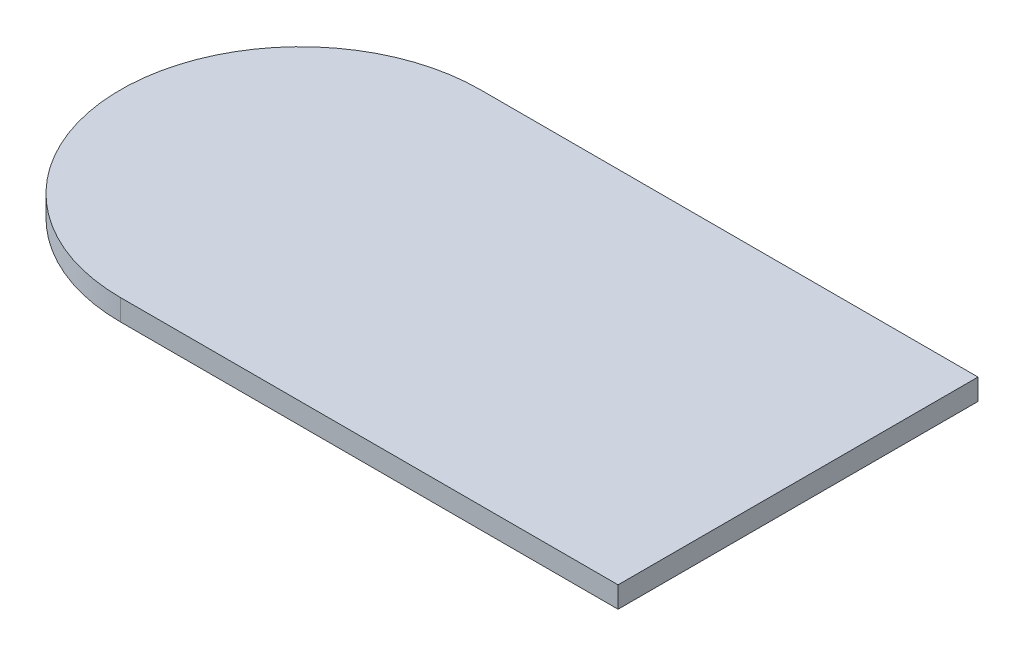
ISO-10303-21;
HEADER;
FILE_DESCRIPTION(('STEP AP214'),'2;1');
FILE_NAME('part.step','',(''),(''),'','','');
FILE_SCHEMA(('AUTOMOTIVE_DESIGN { 1 0 10303 214 1 1 1 1 }'));
ENDSEC;
DATA;
#1=APPLICATION_CONTEXT('core data for automotive mechanical design processes');
#2=APPLICATION_PROTOCOL_DEFINITION('international standard','automotive_design',2000,#1);
#3=PRODUCT_CONTEXT('',#1,'mechanical');
#4=PRODUCT('Part','Part','',(#3));
#5=PRODUCT_RELATED_PRODUCT_CATEGORY('part','',(#4));
#6=PRODUCT_DEFINITION_FORMATION('','',#4);
#7=PRODUCT_DEFINITION_CONTEXT('part definition',#1,'design');
#8=PRODUCT_DEFINITION('design','',#6,#7);
#9=PRODUCT_DEFINITION_SHAPE('','',#8);
#10=(LENGTH_UNIT() NAMED_UNIT(*) SI_UNIT(.MILLI.,.METRE.));
#11=(NAMED_UNIT(*) PLANE_ANGLE_UNIT() SI_UNIT($,.RADIAN.));
#12=(NAMED_UNIT(*) SI_UNIT($,.STERADIAN.) SOLID_ANGLE_UNIT());
#13=UNCERTAINTY_MEASURE_WITH_UNIT(LENGTH_MEASURE(1.E-05),#10,'distance_accuracy_value','');
#14=(GEOMETRIC_REPRESENTATION_CONTEXT(3) GLOBAL_UNCERTAINTY_ASSIGNED_CONTEXT((#13)) GLOBAL_UNIT_ASSIGNED_CONTEXT((#10,
#11,#12)) REPRESENTATION_CONTEXT('',''));
#15=CARTESIAN_POINT('',(0.,0.,0.));
#16=DIRECTION('',(0.,0.,1.));
#17=DIRECTION('',(1.,0.,0.));
#18=AXIS2_PLACEMENT_3D('',#15,#16,#17);
#19=CARTESIAN_POINT('',(0.,2.54,0.));
#20=DIRECTION('',(0.,-1.,0.));
#21=DIRECTION('',(0.,0.,-1.));
#22=AXIS2_PLACEMENT_3D('',#19,#20,#21);
#23=CYLINDRICAL_SURFACE('',#22,21.59);
#24=CARTESIAN_POINT('',(0.,0.,0.));
#25=DIRECTION('',(0.,1.,0.));
#26=DIRECTION('',(0.,0.,1.));
#27=AXIS2_PLACEMENT_3D('',#24,#25,#26);
#28=CIRCLE('',#27,21.59);
#29=CARTESIAN_POINT('',(0.,0.,-21.59));
#30=VERTEX_POINT('',#29);
#31=CARTESIAN_POINT('',(0.,0.,21.59));
#32=VERTEX_POINT('',#31);
#33=EDGE_CURVE('E96',#30,#32,#28,.T.);
#34=ORIENTED_EDGE('',*,*,#33,.T.);
#35=DIRECTION('',(0.,-1.,0.));
#36=VECTOR('',#35,1.);
#37=CARTESIAN_POINT('',(0.,2.54,21.59));
#38=LINE('',#37,#36);
#39=CARTESIAN_POINT('',(0.,2.54,21.59));
#40=VERTEX_POINT('',#39);
#41=EDGE_CURVE('E11',#40,#32,#38,.T.);
#42=ORIENTED_EDGE('',*,*,#41,.F.);
#43=CARTESIAN_POINT('',(0.,2.54,0.));
#44=DIRECTION('',(0.,1.,0.));
#45=DIRECTION('',(0.,0.,1.));
#46=AXIS2_PLACEMENT_3D('',#43,#44,#45);
#47=CIRCLE('',#46,21.59);
#48=CARTESIAN_POINT('',(0.,2.54,-21.59));
#49=VERTEX_POINT('',#48);
#50=EDGE_CURVE('E84',#49,#40,#47,.T.);
#51=ORIENTED_EDGE('',*,*,#50,.F.);
#52=DIRECTION('',(0.,-1.,0.));
#53=VECTOR('',#52,1.);
#54=CARTESIAN_POINT('',(0.,2.54,-21.59));
#55=LINE('',#54,#53);
#56=EDGE_CURVE('E92',#49,#30,#55,.T.);
#57=ORIENTED_EDGE('',*,*,#56,.T.);
#58=EDGE_LOOP('',(#34,#42,#51,#57));
#59=FACE_BOUND('',#58,.T.);
#60=ADVANCED_FACE('F33',(#59),#23,.T.);
#61=CARTESIAN_POINT('',(59.6958065519748,2.54,21.59));
#62=DIRECTION('',(0.,0.,-1.));
#63=DIRECTION('',(-1.,0.,0.));
#64=AXIS2_PLACEMENT_3D('',#61,#62,#63);
#65=PLANE('',#64);
#66=DIRECTION('',(1.,0.,0.));
#67=VECTOR('',#66,1.);
#68=CARTESIAN_POINT('',(59.6958065519748,0.,21.59));
#69=LINE('',#68,#67);
#70=CARTESIAN_POINT('',(59.6958065519748,0.,21.59));
#71=VERTEX_POINT('',#70);
#72=EDGE_CURVE('E88',#32,#71,#69,.T.);
#73=ORIENTED_EDGE('',*,*,#72,.T.);
#74=DIRECTION('',(0.,-1.,0.));
#75=VECTOR('',#74,1.);
#76=CARTESIAN_POINT('',(59.6958065519748,2.54,21.59));
#77=LINE('',#76,#75);
#78=CARTESIAN_POINT('',(59.6958065519748,2.54,21.59));
#79=VERTEX_POINT('',#78);
#80=EDGE_CURVE('E41',#79,#71,#77,.T.);
#81=ORIENTED_EDGE('',*,*,#80,.F.);
#82=DIRECTION('',(1.,0.,0.));
#83=VECTOR('',#82,1.);
#84=CARTESIAN_POINT('',(59.6958065519748,2.54,21.59));
#85=LINE('',#84,#83);
#86=EDGE_CURVE('E79',#40,#79,#85,.T.);
#87=ORIENTED_EDGE('',*,*,#86,.F.);
#88=ORIENTED_EDGE('',*,*,#41,.T.);
#89=EDGE_LOOP('',(#73,#81,#87,#88));
#90=FACE_BOUND('',#89,.T.);
#91=ADVANCED_FACE('F87',(#90),#65,.F.);
#92=CARTESIAN_POINT('',(59.6958065519748,2.54,-21.59));
#93=DIRECTION('',(-1.,0.,0.));
#94=DIRECTION('',(0.,0.,1.));
#95=AXIS2_PLACEMENT_3D('',#92,#93,#94);
#96=PLANE('',#95);
#97=DIRECTION('',(0.,0.,-1.));
#98=VECTOR('',#97,1.);
#99=CARTESIAN_POINT('',(59.6958065519748,0.,-21.59));
#100=LINE('',#99,#98);
#101=CARTESIAN_POINT('',(59.6958065519748,0.,-21.59));
#102=VERTEX_POINT('',#101);
#103=EDGE_CURVE('E66',#71,#102,#100,.T.);
#104=ORIENTED_EDGE('',*,*,#103,.T.);
#105=DIRECTION('',(0.,-1.,0.));
#106=VECTOR('',#105,1.);
#107=CARTESIAN_POINT('',(59.6958065519748,2.54,-21.59));
#108=LINE('',#107,#106);
#109=CARTESIAN_POINT('',(59.6958065519748,2.54,-21.59));
#110=VERTEX_POINT('',#109);
#111=EDGE_CURVE('E89',#110,#102,#108,.T.);
#112=ORIENTED_EDGE('',*,*,#111,.F.);
#113=DIRECTION('',(0.,0.,-1.));
#114=VECTOR('',#113,1.);
#115=CARTESIAN_POINT('',(59.6958065519748,2.54,-21.59));
#116=LINE('',#115,#114);
#117=EDGE_CURVE('E82',#79,#110,#116,.T.);
#118=ORIENTED_EDGE('',*,*,#117,.F.);
#119=ORIENTED_EDGE('',*,*,#80,.T.);
#120=EDGE_LOOP('',(#104,#112,#118,#119));
#121=FACE_BOUND('',#120,.T.);
#122=ADVANCED_FACE('F90',(#121),#96,.F.);
#123=CARTESIAN_POINT('',(0.,2.54,-21.59));
#124=DIRECTION('',(0.,0.,1.));
#125=DIRECTION('',(1.,0.,0.));
#126=AXIS2_PLACEMENT_3D('',#123,#124,#125);
#127=PLANE('',#126);
#128=DIRECTION('',(-1.,0.,0.));
#129=VECTOR('',#128,1.);
#130=CARTESIAN_POINT('',(0.,0.,-21.59));
#131=LINE('',#130,#129);
#132=EDGE_CURVE('E72',#102,#30,#131,.T.);
#133=ORIENTED_EDGE('',*,*,#132,.T.);
#134=ORIENTED_EDGE('',*,*,#56,.F.);
#135=DIRECTION('',(-1.,0.,0.));
#136=VECTOR('',#135,1.);
#137=CARTESIAN_POINT('',(0.,2.54,-21.59));
#138=LINE('',#137,#136);
#139=EDGE_CURVE('E49',#110,#49,#138,.T.);
#140=ORIENTED_EDGE('',*,*,#139,.F.);
#141=ORIENTED_EDGE('',*,*,#111,.T.);
#142=EDGE_LOOP('',(#133,#134,#140,#141));
#143=FACE_BOUND('',#142,.T.);
#144=ADVANCED_FACE('F103',(#143),#127,.F.);
#145=CARTESIAN_POINT('',(0.,2.54,0.));
#146=DIRECTION('',(0.,1.,0.));
#147=DIRECTION('',(0.,0.,1.));
#148=AXIS2_PLACEMENT_3D('',#145,#146,#147);
#149=PLANE('',#148);
#150=ORIENTED_EDGE('',*,*,#50,.T.);
#151=ORIENTED_EDGE('',*,*,#86,.T.);
#152=ORIENTED_EDGE('',*,*,#117,.T.);
#153=ORIENTED_EDGE('',*,*,#139,.T.);
#154=EDGE_LOOP('',(#150,#151,#152,#153));
#155=FACE_BOUND('',#154,.T.);
#156=ADVANCED_FACE('F80',(#155),#149,.T.);
#157=CARTESIAN_POINT('',(0.,0.,0.));
#158=DIRECTION('',(0.,1.,0.));
#159=DIRECTION('',(0.,0.,1.));
#160=AXIS2_PLACEMENT_3D('',#157,#158,#159);
#161=PLANE('',#160);
#162=ORIENTED_EDGE('',*,*,#33,.F.);
#163=ORIENTED_EDGE('',*,*,#132,.F.);
#164=ORIENTED_EDGE('',*,*,#103,.F.);
#165=ORIENTED_EDGE('',*,*,#72,.F.);
#166=EDGE_LOOP('',(#162,#163,#164,#165));
#167=FACE_BOUND('',#166,.T.);
#168=ADVANCED_FACE('F106',(#167),#161,.F.);
#169=CLOSED_SHELL('',(#60,#91,#122,#144,#156,#168));
#170=MANIFOLD_SOLID_BREP('B2',#169);
#171=ADVANCED_BREP_SHAPE_REPRESENTATION('',(#18,#170),#14);
#172=SHAPE_DEFINITION_REPRESENTATION(#9,#171);
ENDSEC;
END-ISO-10303-21;
